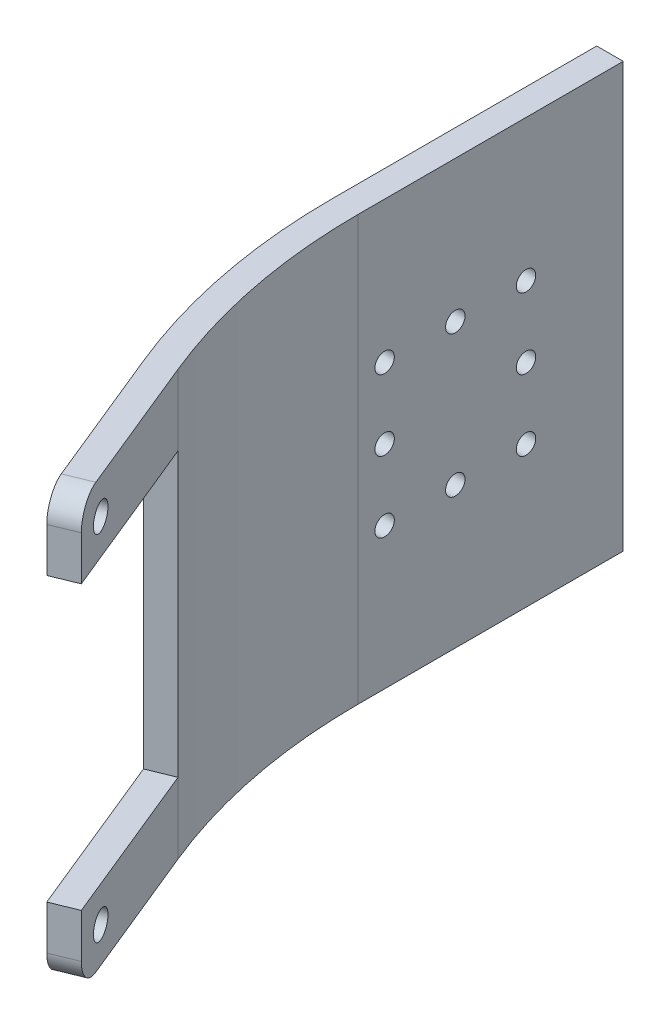
ISO-10303-21;
HEADER;
FILE_DESCRIPTION(('STEP AP214'),'2;1');
FILE_NAME('part.step','',(''),(''),'','','');
FILE_SCHEMA(('AUTOMOTIVE_DESIGN { 1 0 10303 214 1 1 1 1 }'));
ENDSEC;
DATA;
#1=APPLICATION_CONTEXT('core data for automotive mechanical design processes');
#2=APPLICATION_PROTOCOL_DEFINITION('international standard','automotive_design',2000,#1);
#3=PRODUCT_CONTEXT('',#1,'mechanical');
#4=PRODUCT('Part','Part','',(#3));
#5=PRODUCT_RELATED_PRODUCT_CATEGORY('part','',(#4));
#6=PRODUCT_DEFINITION_FORMATION('','',#4);
#7=PRODUCT_DEFINITION_CONTEXT('part definition',#1,'design');
#8=PRODUCT_DEFINITION('design','',#6,#7);
#9=PRODUCT_DEFINITION_SHAPE('','',#8);
#10=(LENGTH_UNIT() NAMED_UNIT(*) SI_UNIT(.MILLI.,.METRE.));
#11=(NAMED_UNIT(*) PLANE_ANGLE_UNIT() SI_UNIT($,.RADIAN.));
#12=(NAMED_UNIT(*) SI_UNIT($,.STERADIAN.) SOLID_ANGLE_UNIT());
#13=UNCERTAINTY_MEASURE_WITH_UNIT(LENGTH_MEASURE(1.E-05),#10,'distance_accuracy_value','');
#14=(GEOMETRIC_REPRESENTATION_CONTEXT(3) GLOBAL_UNCERTAINTY_ASSIGNED_CONTEXT((#13)) GLOBAL_UNIT_ASSIGNED_CONTEXT((#10,
#11,#12)) REPRESENTATION_CONTEXT('',''));
#15=CARTESIAN_POINT('',(0.,0.,0.));
#16=DIRECTION('',(0.,0.,1.));
#17=DIRECTION('',(1.,0.,0.));
#18=AXIS2_PLACEMENT_3D('',#15,#16,#17);
#19=CARTESIAN_POINT('',(5.20465717257355,48.,26.4870449064496));
#20=DIRECTION('',(0.925647754677521,0.,-0.378386355806422));
#21=DIRECTION('',(-0.378386355806423,0.,-0.925647754677521));
#22=AXIS2_PLACEMENT_3D('',#19,#20,#21);
#23=PLANE('',#22);
#24=CARTESIAN_POINT('',(11.2588388654763,44.,41.2974089812899));
#25=DIRECTION('',(-0.925647754677521,0.,0.378386355806422));
#26=DIRECTION('',(-0.378386355806422,0.,-0.925647754677521));
#27=AXIS2_PLACEMENT_3D('',#24,#25,#26);
#28=CIRCLE('',#27,1.5);
#29=CARTESIAN_POINT('',(10.6912593317667,44.,39.9089373492736));
#30=VERTEX_POINT('',#29);
#31=EDGE_CURVE('E365',#30,#30,#28,.T.);
#32=ORIENTED_EDGE('',*,*,#31,.F.);
#33=EDGE_LOOP('',(#32));
#34=FACE_BOUND('',#33,.T.);
#35=DIRECTION('',(0.,-1.,0.));
#36=VECTOR('',#35,1.);
#37=CARTESIAN_POINT('',(12.772384288702,48.,45.));
#38=LINE('',#37,#36);
#39=CARTESIAN_POINT('',(12.772384288702,45.,45.));
#40=VERTEX_POINT('',#39);
#41=CARTESIAN_POINT('',(12.772384288702,40.,45.));
#42=VERTEX_POINT('',#41);
#43=EDGE_CURVE('E176',#40,#42,#38,.T.);
#44=ORIENTED_EDGE('',*,*,#43,.F.);
#45=CARTESIAN_POINT('',(11.6372252212827,45.,42.2230567359674));
#46=DIRECTION('',(0.925647754677521,0.,-0.378386355806422));
#47=DIRECTION('',(-0.378386355806423,0.,-0.925647754677521));
#48=AXIS2_PLACEMENT_3D('',#45,#46,#47);
#49=CIRCLE('',#48,3.);
#50=CARTESIAN_POINT('',(11.6372252212827,48.,42.2230567359674));
#51=VERTEX_POINT('',#50);
#52=EDGE_CURVE('E11',#40,#51,#49,.F.);
#53=ORIENTED_EDGE('',*,*,#52,.T.);
#54=DIRECTION('',(0.378386355806422,0.,0.925647754677521));
#55=VECTOR('',#54,1.);
#56=CARTESIAN_POINT('',(5.20465717257355,48.,26.4870449064496));
#57=LINE('',#56,#55);
#58=CARTESIAN_POINT('',(5.20465717257355,48.,26.4870449064496));
#59=VERTEX_POINT('',#58);
#60=EDGE_CURVE('E200',#59,#51,#57,.T.);
#61=ORIENTED_EDGE('',*,*,#60,.F.);
#62=DIRECTION('',(0.,-1.,0.));
#63=VECTOR('',#62,1.);
#64=CARTESIAN_POINT('',(5.20465717257355,48.,26.4870449064496));
#65=LINE('',#64,#63);
#66=CARTESIAN_POINT('',(5.20465717257355,40.,26.4870449064496));
#67=VERTEX_POINT('',#66);
#68=EDGE_CURVE('E179',#59,#67,#65,.T.);
#69=ORIENTED_EDGE('',*,*,#68,.T.);
#70=DIRECTION('',(-0.378386355806423,0.,-0.925647754677521));
#71=VECTOR('',#70,1.);
#72=CARTESIAN_POINT('',(12.772384288702,40.,45.));
#73=LINE('',#72,#71);
#74=EDGE_CURVE('E138',#42,#67,#73,.T.);
#75=ORIENTED_EDGE('',*,*,#74,.F.);
#76=EDGE_LOOP('',(#44,#53,#61,#69,#75));
#77=FACE_BOUND('',#76,.T.);
#78=ADVANCED_FACE('F31',(#34,#77),#23,.F.);
#79=CARTESIAN_POINT('',(12.772384288702,48.,45.));
#80=DIRECTION('',(-0.378386355806423,0.,-0.92564775467752));
#81=DIRECTION('',(-0.92564775467752,0.,0.378386355806423));
#82=AXIS2_PLACEMENT_3D('',#79,#80,#81);
#83=PLANE('',#82);
#84=DIRECTION('',(0.,-1.,0.));
#85=VECTOR('',#84,1.);
#86=CARTESIAN_POINT('',(15.5493275527346,48.,43.8648409325807));
#87=LINE('',#86,#85);
#88=CARTESIAN_POINT('',(15.5493275527346,45.,43.8648409325807));
#89=VERTEX_POINT('',#88);
#90=CARTESIAN_POINT('',(15.5493275527346,40.,43.8648409325807));
#91=VERTEX_POINT('',#90);
#92=EDGE_CURVE('E160',#89,#91,#87,.T.);
#93=ORIENTED_EDGE('',*,*,#92,.F.);
#94=DIRECTION('',(0.92564775467752,0.,-0.378386355806423));
#95=VECTOR('',#94,1.);
#96=CARTESIAN_POINT('',(12.772384288702,45.,45.));
#97=LINE('',#96,#95);
#98=EDGE_CURVE('E39',#89,#40,#97,.F.);
#99=ORIENTED_EDGE('',*,*,#98,.T.);
#100=ORIENTED_EDGE('',*,*,#43,.T.);
#101=DIRECTION('',(-0.925647754677521,0.,0.378386355806422));
#102=VECTOR('',#101,1.);
#103=CARTESIAN_POINT('',(41.4218783986437,40.,33.2886577348907));
#104=LINE('',#103,#102);
#105=EDGE_CURVE('E154',#91,#42,#104,.T.);
#106=ORIENTED_EDGE('',*,*,#105,.F.);
#107=EDGE_LOOP('',(#93,#99,#100,#106));
#108=FACE_BOUND('',#107,.T.);
#109=ADVANCED_FACE('F278',(#108),#83,.F.);
#110=CARTESIAN_POINT('',(7.98160043660612,48.,25.3518858390303));
#111=DIRECTION('',(-0.925647754677521,0.,0.378386355806423));
#112=DIRECTION('',(0.378386355806423,0.,0.925647754677521));
#113=AXIS2_PLACEMENT_3D('',#110,#111,#112);
#114=PLANE('',#113);
#115=CARTESIAN_POINT('',(14.0357821295089,44.,40.1622499138706));
#116=DIRECTION('',(-0.925647754677521,0.,0.378386355806423));
#117=DIRECTION('',(0.378386355806423,0.,0.925647754677521));
#118=AXIS2_PLACEMENT_3D('',#115,#116,#117);
#119=CIRCLE('',#118,1.5);
#120=CARTESIAN_POINT('',(14.6033616632185,44.,41.5507215458869));
#121=VERTEX_POINT('',#120);
#122=EDGE_CURVE('E363',#121,#121,#119,.F.);
#123=ORIENTED_EDGE('',*,*,#122,.F.);
#124=EDGE_LOOP('',(#123));
#125=FACE_BOUND('',#124,.T.);
#126=DIRECTION('',(-0.378386355806423,0.,-0.925647754677521));
#127=VECTOR('',#126,1.);
#128=CARTESIAN_POINT('',(7.98160043660612,48.,25.3518858390303));
#129=LINE('',#128,#127);
#130=CARTESIAN_POINT('',(14.4141684853153,48.,41.0878976685482));
#131=VERTEX_POINT('',#130);
#132=CARTESIAN_POINT('',(7.98160043660612,48.,25.3518858390303));
#133=VERTEX_POINT('',#132);
#134=EDGE_CURVE('E198',#131,#133,#129,.T.);
#135=ORIENTED_EDGE('',*,*,#134,.F.);
#136=CARTESIAN_POINT('',(14.4141684853153,45.,41.0878976685482));
#137=DIRECTION('',(-0.925647754677521,0.,0.378386355806423));
#138=DIRECTION('',(0.378386355806423,0.,0.925647754677521));
#139=AXIS2_PLACEMENT_3D('',#136,#137,#138);
#140=CIRCLE('',#139,3.);
#141=EDGE_CURVE('E53',#131,#89,#140,.F.);
#142=ORIENTED_EDGE('',*,*,#141,.T.);
#143=ORIENTED_EDGE('',*,*,#92,.T.);
#144=DIRECTION('',(0.378386355806423,0.,0.925647754677521));
#145=VECTOR('',#144,1.);
#146=CARTESIAN_POINT('',(15.5493275527346,40.,43.8648409325807));
#147=LINE('',#146,#145);
#148=CARTESIAN_POINT('',(7.98160043660612,40.,25.3518858390303));
#149=VERTEX_POINT('',#148);
#150=EDGE_CURVE('E135',#149,#91,#147,.T.);
#151=ORIENTED_EDGE('',*,*,#150,.F.);
#152=DIRECTION('',(0.,-1.,0.));
#153=VECTOR('',#152,1.);
#154=CARTESIAN_POINT('',(7.98160043660612,48.,25.3518858390303));
#155=LINE('',#154,#153);
#156=EDGE_CURVE('E158',#133,#149,#155,.T.);
#157=ORIENTED_EDGE('',*,*,#156,.F.);
#158=EDGE_LOOP('',(#135,#142,#143,#151,#157));
#159=FACE_BOUND('',#158,.T.);
#160=ADVANCED_FACE('F157',(#125,#159),#114,.F.);
#161=CARTESIAN_POINT('',(70.,48.,0.));
#162=DIRECTION('',(0.,-1.,0.));
#163=DIRECTION('',(0.,0.,-1.));
#164=AXIS2_PLACEMENT_3D('',#161,#162,#163);
#165=CYLINDRICAL_SURFACE('',#164,70.);
#166=CARTESIAN_POINT('',(70.,0.,0.));
#167=DIRECTION('',(0.,1.,0.));
#168=DIRECTION('',(0.,0.,1.));
#169=AXIS2_PLACEMENT_3D('',#166,#167,#168);
#170=CIRCLE('',#169,70.);
#171=CARTESIAN_POINT('',(0.,0.,0.));
#172=VERTEX_POINT('',#171);
#173=CARTESIAN_POINT('',(5.20465717257355,0.,26.4870449064496));
#174=VERTEX_POINT('',#173);
#175=EDGE_CURVE('E153',#172,#174,#170,.T.);
#176=ORIENTED_EDGE('',*,*,#175,.T.);
#177=CARTESIAN_POINT('',(5.20465717257355,8.,26.4870449064496));
#178=VERTEX_POINT('',#177);
#179=EDGE_CURVE('E178',#178,#174,#65,.T.);
#180=ORIENTED_EDGE('',*,*,#179,.F.);
#181=DIRECTION('',(0.,-1.,0.));
#182=VECTOR('',#181,1.);
#183=CARTESIAN_POINT('',(5.20465717257355,8.,26.4870449064496));
#184=LINE('',#183,#182);
#185=EDGE_CURVE('E263',#67,#178,#184,.T.);
#186=ORIENTED_EDGE('',*,*,#185,.F.);
#187=ORIENTED_EDGE('',*,*,#68,.F.);
#188=CARTESIAN_POINT('',(70.,48.,0.));
#189=DIRECTION('',(0.,1.,0.));
#190=DIRECTION('',(0.,0.,1.));
#191=AXIS2_PLACEMENT_3D('',#188,#189,#190);
#192=CIRCLE('',#191,70.);
#193=CARTESIAN_POINT('',(0.,48.,0.));
#194=VERTEX_POINT('',#193);
#195=EDGE_CURVE('E206',#194,#59,#192,.T.);
#196=ORIENTED_EDGE('',*,*,#195,.F.);
#197=DIRECTION('',(0.,-1.,0.));
#198=VECTOR('',#197,1.);
#199=CARTESIAN_POINT('',(0.,48.,0.));
#200=LINE('',#199,#198);
#201=EDGE_CURVE('E215',#194,#172,#200,.T.);
#202=ORIENTED_EDGE('',*,*,#201,.T.);
#203=EDGE_LOOP('',(#176,#180,#186,#187,#196,#202));
#204=FACE_BOUND('',#203,.T.);
#205=ADVANCED_FACE('F261',(#204),#165,.T.);
#206=CARTESIAN_POINT('',(11.2588388654763,4.,41.2974089812899));
#207=DIRECTION('',(-0.925647754677521,0.,0.378386355806422));
#208=DIRECTION('',(0.378386355806422,0.,0.925647754677521));
#209=AXIS2_PLACEMENT_3D('',#206,#207,#208);
#210=CIRCLE('',#209,1.5);
#211=CARTESIAN_POINT('',(11.8264183991859,4.,42.6858806133062));
#212=VERTEX_POINT('',#211);
#213=EDGE_CURVE('E300',#212,#212,#210,.T.);
#214=ORIENTED_EDGE('',*,*,#213,.F.);
#215=EDGE_LOOP('',(#214));
#216=FACE_BOUND('',#215,.T.);
#217=DIRECTION('',(0.378386355806422,0.,0.925647754677521));
#218=VECTOR('',#217,1.);
#219=CARTESIAN_POINT('',(5.20465717257355,0.,26.4870449064496));
#220=LINE('',#219,#218);
#221=CARTESIAN_POINT('',(11.6372252212827,0.,42.2230567359674));
#222=VERTEX_POINT('',#221);
#223=EDGE_CURVE('E218',#174,#222,#220,.T.);
#224=ORIENTED_EDGE('',*,*,#223,.T.);
#225=CARTESIAN_POINT('',(11.6372252212827,3.,42.2230567359674));
#226=DIRECTION('',(0.925647754677521,0.,-0.378386355806422));
#227=DIRECTION('',(-0.378386355806423,0.,-0.925647754677521));
#228=AXIS2_PLACEMENT_3D('',#225,#226,#227);
#229=CIRCLE('',#228,3.);
#230=CARTESIAN_POINT('',(12.772384288702,3.,45.));
#231=VERTEX_POINT('',#230);
#232=EDGE_CURVE('E189',#222,#231,#229,.F.);
#233=ORIENTED_EDGE('',*,*,#232,.T.);
#234=CARTESIAN_POINT('',(12.772384288702,8.,45.));
#235=VERTEX_POINT('',#234);
#236=EDGE_CURVE('E175',#235,#231,#38,.T.);
#237=ORIENTED_EDGE('',*,*,#236,.F.);
#238=DIRECTION('',(0.378386355806422,0.,0.925647754677521));
#239=VECTOR('',#238,1.);
#240=CARTESIAN_POINT('',(12.772384288702,8.,45.));
#241=LINE('',#240,#239);
#242=EDGE_CURVE('E143',#178,#235,#241,.T.);
#243=ORIENTED_EDGE('',*,*,#242,.F.);
#244=ORIENTED_EDGE('',*,*,#179,.T.);
#245=EDGE_LOOP('',(#224,#233,#237,#243,#244));
#246=FACE_BOUND('',#245,.T.);
#247=ADVANCED_FACE('F281',(#216,#246),#23,.F.);
#248=ORIENTED_EDGE('',*,*,#236,.T.);
#249=DIRECTION('',(0.92564775467752,0.,-0.378386355806423));
#250=VECTOR('',#249,1.);
#251=CARTESIAN_POINT('',(12.772384288702,3.,45.));
#252=LINE('',#251,#250);
#253=CARTESIAN_POINT('',(15.5493275527346,3.,43.8648409325807));
#254=VERTEX_POINT('',#253);
#255=EDGE_CURVE('E182',#231,#254,#252,.T.);
#256=ORIENTED_EDGE('',*,*,#255,.T.);
#257=CARTESIAN_POINT('',(15.5493275527346,8.,43.8648409325807));
#258=VERTEX_POINT('',#257);
#259=EDGE_CURVE('E166',#258,#254,#87,.T.);
#260=ORIENTED_EDGE('',*,*,#259,.F.);
#261=DIRECTION('',(-0.925647754677521,0.,0.378386355806422));
#262=VECTOR('',#261,1.);
#263=CARTESIAN_POINT('',(41.4218783986437,8.,33.2886577348907));
#264=LINE('',#263,#262);
#265=EDGE_CURVE('E323',#258,#235,#264,.T.);
#266=ORIENTED_EDGE('',*,*,#265,.T.);
#267=EDGE_LOOP('',(#248,#256,#260,#266));
#268=FACE_BOUND('',#267,.T.);
#269=ADVANCED_FACE('F286',(#268),#83,.F.);
#270=CARTESIAN_POINT('',(14.0357821295089,4.,40.1622499138706));
#271=DIRECTION('',(-0.925647754677521,0.,0.378386355806423));
#272=DIRECTION('',(0.378386355806423,0.,0.925647754677521));
#273=AXIS2_PLACEMENT_3D('',#270,#271,#272);
#274=CIRCLE('',#273,1.5);
#275=CARTESIAN_POINT('',(14.6033616632185,4.,41.5507215458869));
#276=VERTEX_POINT('',#275);
#277=EDGE_CURVE('E313',#276,#276,#274,.F.);
#278=ORIENTED_EDGE('',*,*,#277,.F.);
#279=EDGE_LOOP('',(#278));
#280=FACE_BOUND('',#279,.T.);
#281=ORIENTED_EDGE('',*,*,#259,.T.);
#282=CARTESIAN_POINT('',(14.4141684853153,3.,41.0878976685482));
#283=DIRECTION('',(-0.925647754677521,0.,0.378386355806423));
#284=DIRECTION('',(0.378386355806423,0.,0.925647754677521));
#285=AXIS2_PLACEMENT_3D('',#282,#283,#284);
#286=CIRCLE('',#285,3.);
#287=CARTESIAN_POINT('',(14.4141684853153,0.,41.0878976685482));
#288=VERTEX_POINT('',#287);
#289=EDGE_CURVE('E185',#254,#288,#286,.F.);
#290=ORIENTED_EDGE('',*,*,#289,.T.);
#291=DIRECTION('',(-0.378386355806423,0.,-0.925647754677521));
#292=VECTOR('',#291,1.);
#293=CARTESIAN_POINT('',(7.98160043660612,0.,25.3518858390303));
#294=LINE('',#293,#292);
#295=CARTESIAN_POINT('',(7.98160043660612,0.,25.3518858390303));
#296=VERTEX_POINT('',#295);
#297=EDGE_CURVE('E221',#288,#296,#294,.T.);
#298=ORIENTED_EDGE('',*,*,#297,.T.);
#299=CARTESIAN_POINT('',(7.98160043660612,8.,25.3518858390303));
#300=VERTEX_POINT('',#299);
#301=EDGE_CURVE('E167',#300,#296,#155,.T.);
#302=ORIENTED_EDGE('',*,*,#301,.F.);
#303=DIRECTION('',(-0.378386355806423,0.,-0.925647754677521));
#304=VECTOR('',#303,1.);
#305=CARTESIAN_POINT('',(15.5493275527346,8.,43.8648409325807));
#306=LINE('',#305,#304);
#307=EDGE_CURVE('E161',#258,#300,#306,.T.);
#308=ORIENTED_EDGE('',*,*,#307,.F.);
#309=EDGE_LOOP('',(#281,#290,#298,#302,#308));
#310=FACE_BOUND('',#309,.T.);
#311=ADVANCED_FACE('F295',(#280,#310),#114,.F.);
#312=CARTESIAN_POINT('',(70.,48.,0.));
#313=DIRECTION('',(0.,-1.,0.));
#314=DIRECTION('',(0.,0.,-1.));
#315=AXIS2_PLACEMENT_3D('',#312,#313,#314);
#316=CYLINDRICAL_SURFACE('',#315,67.);
#317=CARTESIAN_POINT('',(70.,0.,0.));
#318=DIRECTION('',(0.,-1.,0.));
#319=DIRECTION('',(0.,0.,1.));
#320=AXIS2_PLACEMENT_3D('',#317,#318,#319);
#321=CIRCLE('',#320,67.);
#322=CARTESIAN_POINT('',(3.00000000000001,0.,7.12266617214352E-13));
#323=VERTEX_POINT('',#322);
#324=EDGE_CURVE('E223',#296,#323,#321,.T.);
#325=ORIENTED_EDGE('',*,*,#324,.T.);
#326=DIRECTION('',(0.,-1.,0.));
#327=VECTOR('',#326,1.);
#328=CARTESIAN_POINT('',(3.00000000000001,48.,7.12266617214352E-13));
#329=LINE('',#328,#327);
#330=CARTESIAN_POINT('',(3.00000000000001,48.,7.12266617214352E-13));
#331=VERTEX_POINT('',#330);
#332=EDGE_CURVE('E171',#331,#323,#329,.T.);
#333=ORIENTED_EDGE('',*,*,#332,.F.);
#334=CARTESIAN_POINT('',(70.,48.,0.));
#335=DIRECTION('',(0.,-1.,0.));
#336=DIRECTION('',(0.,0.,1.));
#337=AXIS2_PLACEMENT_3D('',#334,#335,#336);
#338=CIRCLE('',#337,67.);
#339=EDGE_CURVE('E165',#133,#331,#338,.T.);
#340=ORIENTED_EDGE('',*,*,#339,.F.);
#341=ORIENTED_EDGE('',*,*,#156,.T.);
#342=DIRECTION('',(0.,-1.,0.));
#343=VECTOR('',#342,1.);
#344=CARTESIAN_POINT('',(7.98160043660611,48.,25.3518858390303));
#345=LINE('',#344,#343);
#346=EDGE_CURVE('E147',#300,#149,#345,.F.);
#347=ORIENTED_EDGE('',*,*,#346,.F.);
#348=ORIENTED_EDGE('',*,*,#301,.T.);
#349=EDGE_LOOP('',(#325,#333,#340,#341,#347,#348));
#350=FACE_BOUND('',#349,.T.);
#351=ADVANCED_FACE('F163',(#350),#316,.F.);
#352=CARTESIAN_POINT('',(3.,48.,-30.));
#353=DIRECTION('',(-1.,0.,0.));
#354=DIRECTION('',(0.,0.,1.));
#355=AXIS2_PLACEMENT_3D('',#352,#353,#354);
#356=PLANE('',#355);
#357=CARTESIAN_POINT('',(3.00000000000001,32.,-2.99999999999999));
#358=DIRECTION('',(1.,0.,0.));
#359=DIRECTION('',(0.,0.,1.));
#360=AXIS2_PLACEMENT_3D('',#357,#358,#359);
#361=CIRCLE('',#360,1.1);
#362=CARTESIAN_POINT('',(3.00000000000001,32.,-1.89999999999999));
#363=VERTEX_POINT('',#362);
#364=EDGE_CURVE('E415',#363,#363,#361,.T.);
#365=ORIENTED_EDGE('',*,*,#364,.F.);
#366=EDGE_LOOP('',(#365));
#367=FACE_BOUND('',#366,.T.);
#368=CARTESIAN_POINT('',(3.,32.,-11.));
#369=DIRECTION('',(1.,0.,0.));
#370=DIRECTION('',(0.,0.,1.));
#371=AXIS2_PLACEMENT_3D('',#368,#369,#370);
#372=CIRCLE('',#371,1.1);
#373=CARTESIAN_POINT('',(3.,32.,-9.9));
#374=VERTEX_POINT('',#373);
#375=EDGE_CURVE('E409',#374,#374,#372,.T.);
#376=ORIENTED_EDGE('',*,*,#375,.F.);
#377=EDGE_LOOP('',(#376));
#378=FACE_BOUND('',#377,.T.);
#379=CARTESIAN_POINT('',(3.,32.,-19.));
#380=DIRECTION('',(1.,0.,0.));
#381=DIRECTION('',(0.,0.,1.));
#382=AXIS2_PLACEMENT_3D('',#379,#380,#381);
#383=CIRCLE('',#382,1.1);
#384=CARTESIAN_POINT('',(3.,32.,-17.9));
#385=VERTEX_POINT('',#384);
#386=EDGE_CURVE('E403',#385,#385,#383,.T.);
#387=ORIENTED_EDGE('',*,*,#386,.F.);
#388=EDGE_LOOP('',(#387));
#389=FACE_BOUND('',#388,.T.);
#390=CARTESIAN_POINT('',(3.,24.,-19.));
#391=DIRECTION('',(1.,0.,0.));
#392=DIRECTION('',(0.,0.,-1.));
#393=AXIS2_PLACEMENT_3D('',#390,#391,#392);
#394=CIRCLE('',#393,1.1);
#395=CARTESIAN_POINT('',(3.,24.,-20.1));
#396=VERTEX_POINT('',#395);
#397=EDGE_CURVE('E397',#396,#396,#394,.T.);
#398=ORIENTED_EDGE('',*,*,#397,.F.);
#399=EDGE_LOOP('',(#398));
#400=FACE_BOUND('',#399,.T.);
#401=CARTESIAN_POINT('',(3.00000000000001,24.,-3.));
#402=DIRECTION('',(1.,0.,0.));
#403=DIRECTION('',(0.,0.,-1.));
#404=AXIS2_PLACEMENT_3D('',#401,#402,#403);
#405=CIRCLE('',#404,1.1);
#406=CARTESIAN_POINT('',(3.,24.,-4.1));
#407=VERTEX_POINT('',#406);
#408=EDGE_CURVE('E391',#407,#407,#405,.T.);
#409=ORIENTED_EDGE('',*,*,#408,.F.);
#410=EDGE_LOOP('',(#409));
#411=FACE_BOUND('',#410,.T.);
#412=CARTESIAN_POINT('',(3.,16.,-19.));
#413=DIRECTION('',(1.,0.,0.));
#414=DIRECTION('',(0.,0.,-1.));
#415=AXIS2_PLACEMENT_3D('',#412,#413,#414);
#416=CIRCLE('',#415,1.1);
#417=CARTESIAN_POINT('',(3.,16.,-20.1));
#418=VERTEX_POINT('',#417);
#419=EDGE_CURVE('E385',#418,#418,#416,.T.);
#420=ORIENTED_EDGE('',*,*,#419,.F.);
#421=EDGE_LOOP('',(#420));
#422=FACE_BOUND('',#421,.T.);
#423=CARTESIAN_POINT('',(3.,16.,-11.));
#424=DIRECTION('',(1.,0.,0.));
#425=DIRECTION('',(0.,0.,-1.));
#426=AXIS2_PLACEMENT_3D('',#423,#424,#425);
#427=CIRCLE('',#426,1.1);
#428=CARTESIAN_POINT('',(3.,16.,-12.1));
#429=VERTEX_POINT('',#428);
#430=EDGE_CURVE('E379',#429,#429,#427,.T.);
#431=ORIENTED_EDGE('',*,*,#430,.F.);
#432=EDGE_LOOP('',(#431));
#433=FACE_BOUND('',#432,.T.);
#434=CARTESIAN_POINT('',(3.00000000000001,16.,-3.));
#435=DIRECTION('',(1.,0.,0.));
#436=DIRECTION('',(0.,0.,-1.));
#437=AXIS2_PLACEMENT_3D('',#434,#435,#436);
#438=CIRCLE('',#437,1.1);
#439=CARTESIAN_POINT('',(3.,16.,-4.1));
#440=VERTEX_POINT('',#439);
#441=EDGE_CURVE('E373',#440,#440,#438,.T.);
#442=ORIENTED_EDGE('',*,*,#441,.F.);
#443=EDGE_LOOP('',(#442));
#444=FACE_BOUND('',#443,.T.);
#445=DIRECTION('',(0.,0.,-1.));
#446=VECTOR('',#445,1.);
#447=CARTESIAN_POINT('',(3.,0.,-30.));
#448=LINE('',#447,#446);
#449=CARTESIAN_POINT('',(3.,0.,-30.));
#450=VERTEX_POINT('',#449);
#451=EDGE_CURVE('E225',#323,#450,#448,.T.);
#452=ORIENTED_EDGE('',*,*,#451,.T.);
#453=DIRECTION('',(0.,-1.,0.));
#454=VECTOR('',#453,1.);
#455=CARTESIAN_POINT('',(3.,48.,-30.));
#456=LINE('',#455,#454);
#457=CARTESIAN_POINT('',(3.,48.,-30.));
#458=VERTEX_POINT('',#457);
#459=EDGE_CURVE('E235',#458,#450,#456,.T.);
#460=ORIENTED_EDGE('',*,*,#459,.F.);
#461=DIRECTION('',(0.,0.,-1.));
#462=VECTOR('',#461,1.);
#463=CARTESIAN_POINT('',(3.,48.,-30.));
#464=LINE('',#463,#462);
#465=EDGE_CURVE('E204',#331,#458,#464,.T.);
#466=ORIENTED_EDGE('',*,*,#465,.F.);
#467=ORIENTED_EDGE('',*,*,#332,.T.);
#468=EDGE_LOOP('',(#452,#460,#466,#467));
#469=FACE_BOUND('',#468,.T.);
#470=ADVANCED_FACE('F245',(#367,#378,#389,#400,#411,#422,#433,#444,#469),#356,.F.);
#471=CARTESIAN_POINT('',(0.,48.,-30.));
#472=DIRECTION('',(0.,0.,1.));
#473=DIRECTION('',(1.,0.,0.));
#474=AXIS2_PLACEMENT_3D('',#471,#472,#473);
#475=PLANE('',#474);
#476=DIRECTION('',(-1.,0.,0.));
#477=VECTOR('',#476,1.);
#478=CARTESIAN_POINT('',(0.,0.,-30.));
#479=LINE('',#478,#477);
#480=CARTESIAN_POINT('',(0.,0.,-30.));
#481=VERTEX_POINT('',#480);
#482=EDGE_CURVE('E227',#450,#481,#479,.T.);
#483=ORIENTED_EDGE('',*,*,#482,.T.);
#484=DIRECTION('',(0.,-1.,0.));
#485=VECTOR('',#484,1.);
#486=CARTESIAN_POINT('',(0.,48.,-30.));
#487=LINE('',#486,#485);
#488=CARTESIAN_POINT('',(0.,48.,-30.));
#489=VERTEX_POINT('',#488);
#490=EDGE_CURVE('E233',#489,#481,#487,.T.);
#491=ORIENTED_EDGE('',*,*,#490,.F.);
#492=DIRECTION('',(-1.,0.,0.));
#493=VECTOR('',#492,1.);
#494=CARTESIAN_POINT('',(0.,48.,-30.));
#495=LINE('',#494,#493);
#496=EDGE_CURVE('E211',#458,#489,#495,.T.);
#497=ORIENTED_EDGE('',*,*,#496,.F.);
#498=ORIENTED_EDGE('',*,*,#459,.T.);
#499=EDGE_LOOP('',(#483,#491,#497,#498));
#500=FACE_BOUND('',#499,.T.);
#501=ADVANCED_FACE('F253',(#500),#475,.F.);
#502=CARTESIAN_POINT('',(0.,48.,0.));
#503=DIRECTION('',(1.,0.,0.));
#504=DIRECTION('',(0.,0.,-1.));
#505=AXIS2_PLACEMENT_3D('',#502,#503,#504);
#506=PLANE('',#505);
#507=CARTESIAN_POINT('',(0.,32.,-2.99999999999999));
#508=DIRECTION('',(1.,0.,0.));
#509=DIRECTION('',(0.,0.,-1.));
#510=AXIS2_PLACEMENT_3D('',#507,#508,#509);
#511=CIRCLE('',#510,1.1);
#512=CARTESIAN_POINT('',(0.,32.,-4.1));
#513=VERTEX_POINT('',#512);
#514=EDGE_CURVE('E412',#513,#513,#511,.F.);
#515=ORIENTED_EDGE('',*,*,#514,.F.);
#516=EDGE_LOOP('',(#515));
#517=FACE_BOUND('',#516,.T.);
#518=CARTESIAN_POINT('',(0.,32.,-11.));
#519=DIRECTION('',(1.,0.,0.));
#520=DIRECTION('',(0.,0.,-1.));
#521=AXIS2_PLACEMENT_3D('',#518,#519,#520);
#522=CIRCLE('',#521,1.1);
#523=CARTESIAN_POINT('',(0.,32.,-12.1));
#524=VERTEX_POINT('',#523);
#525=EDGE_CURVE('E406',#524,#524,#522,.F.);
#526=ORIENTED_EDGE('',*,*,#525,.F.);
#527=EDGE_LOOP('',(#526));
#528=FACE_BOUND('',#527,.T.);
#529=CARTESIAN_POINT('',(0.,32.,-19.));
#530=DIRECTION('',(1.,0.,0.));
#531=DIRECTION('',(0.,0.,-1.));
#532=AXIS2_PLACEMENT_3D('',#529,#530,#531);
#533=CIRCLE('',#532,1.1);
#534=CARTESIAN_POINT('',(0.,32.,-20.1));
#535=VERTEX_POINT('',#534);
#536=EDGE_CURVE('E400',#535,#535,#533,.F.);
#537=ORIENTED_EDGE('',*,*,#536,.F.);
#538=EDGE_LOOP('',(#537));
#539=FACE_BOUND('',#538,.T.);
#540=CARTESIAN_POINT('',(0.,24.,-19.));
#541=DIRECTION('',(1.,0.,0.));
#542=DIRECTION('',(0.,0.,-1.));
#543=AXIS2_PLACEMENT_3D('',#540,#541,#542);
#544=CIRCLE('',#543,1.1);
#545=CARTESIAN_POINT('',(0.,24.,-20.1));
#546=VERTEX_POINT('',#545);
#547=EDGE_CURVE('E394',#546,#546,#544,.F.);
#548=ORIENTED_EDGE('',*,*,#547,.F.);
#549=EDGE_LOOP('',(#548));
#550=FACE_BOUND('',#549,.T.);
#551=CARTESIAN_POINT('',(0.,24.,-3.));
#552=DIRECTION('',(1.,0.,0.));
#553=DIRECTION('',(0.,0.,-1.));
#554=AXIS2_PLACEMENT_3D('',#551,#552,#553);
#555=CIRCLE('',#554,1.1);
#556=CARTESIAN_POINT('',(0.,24.,-4.1));
#557=VERTEX_POINT('',#556);
#558=EDGE_CURVE('E388',#557,#557,#555,.F.);
#559=ORIENTED_EDGE('',*,*,#558,.F.);
#560=EDGE_LOOP('',(#559));
#561=FACE_BOUND('',#560,.T.);
#562=CARTESIAN_POINT('',(0.,16.,-19.));
#563=DIRECTION('',(1.,0.,0.));
#564=DIRECTION('',(0.,0.,-1.));
#565=AXIS2_PLACEMENT_3D('',#562,#563,#564);
#566=CIRCLE('',#565,1.1);
#567=CARTESIAN_POINT('',(0.,16.,-20.1));
#568=VERTEX_POINT('',#567);
#569=EDGE_CURVE('E382',#568,#568,#566,.F.);
#570=ORIENTED_EDGE('',*,*,#569,.F.);
#571=EDGE_LOOP('',(#570));
#572=FACE_BOUND('',#571,.T.);
#573=CARTESIAN_POINT('',(0.,16.,-11.));
#574=DIRECTION('',(1.,0.,0.));
#575=DIRECTION('',(0.,0.,-1.));
#576=AXIS2_PLACEMENT_3D('',#573,#574,#575);
#577=CIRCLE('',#576,1.1);
#578=CARTESIAN_POINT('',(0.,16.,-12.1));
#579=VERTEX_POINT('',#578);
#580=EDGE_CURVE('E376',#579,#579,#577,.F.);
#581=ORIENTED_EDGE('',*,*,#580,.F.);
#582=EDGE_LOOP('',(#581));
#583=FACE_BOUND('',#582,.T.);
#584=CARTESIAN_POINT('',(0.,16.,-3.));
#585=DIRECTION('',(1.,0.,0.));
#586=DIRECTION('',(0.,0.,-1.));
#587=AXIS2_PLACEMENT_3D('',#584,#585,#586);
#588=CIRCLE('',#587,1.1);
#589=CARTESIAN_POINT('',(0.,16.,-4.1));
#590=VERTEX_POINT('',#589);
#591=EDGE_CURVE('E368',#590,#590,#588,.F.);
#592=ORIENTED_EDGE('',*,*,#591,.F.);
#593=EDGE_LOOP('',(#592));
#594=FACE_BOUND('',#593,.T.);
#595=DIRECTION('',(0.,0.,1.));
#596=VECTOR('',#595,1.);
#597=CARTESIAN_POINT('',(0.,0.,0.));
#598=LINE('',#597,#596);
#599=EDGE_CURVE('E229',#481,#172,#598,.T.);
#600=ORIENTED_EDGE('',*,*,#599,.T.);
#601=ORIENTED_EDGE('',*,*,#201,.F.);
#602=DIRECTION('',(0.,0.,1.));
#603=VECTOR('',#602,1.);
#604=CARTESIAN_POINT('',(0.,48.,0.));
#605=LINE('',#604,#603);
#606=EDGE_CURVE('E213',#489,#194,#605,.T.);
#607=ORIENTED_EDGE('',*,*,#606,.F.);
#608=ORIENTED_EDGE('',*,*,#490,.T.);
#609=EDGE_LOOP('',(#600,#601,#607,#608));
#610=FACE_BOUND('',#609,.T.);
#611=ADVANCED_FACE('F256',(#517,#528,#539,#550,#561,#572,#583,#594,#610),#506,.F.);
#612=CARTESIAN_POINT('',(70.,48.,0.));
#613=DIRECTION('',(0.,1.,0.));
#614=DIRECTION('',(0.,0.,1.));
#615=AXIS2_PLACEMENT_3D('',#612,#613,#614);
#616=PLANE('',#615);
#617=ORIENTED_EDGE('',*,*,#60,.T.);
#618=DIRECTION('',(0.92564775467752,0.,-0.378386355806423));
#619=VECTOR('',#618,1.);
#620=CARTESIAN_POINT('',(14.4141684853153,48.,41.0878976685482));
#621=LINE('',#620,#619);
#622=EDGE_CURVE('E191',#51,#131,#621,.T.);
#623=ORIENTED_EDGE('',*,*,#622,.T.);
#624=ORIENTED_EDGE('',*,*,#134,.T.);
#625=ORIENTED_EDGE('',*,*,#339,.T.);
#626=ORIENTED_EDGE('',*,*,#465,.T.);
#627=ORIENTED_EDGE('',*,*,#496,.T.);
#628=ORIENTED_EDGE('',*,*,#606,.T.);
#629=ORIENTED_EDGE('',*,*,#195,.T.);
#630=EDGE_LOOP('',(#617,#623,#624,#625,#626,#627,#628,#629));
#631=FACE_BOUND('',#630,.T.);
#632=ADVANCED_FACE('F197',(#631),#616,.T.);
#633=CARTESIAN_POINT('',(70.,0.,0.));
#634=DIRECTION('',(0.,1.,0.));
#635=DIRECTION('',(0.,0.,1.));
#636=AXIS2_PLACEMENT_3D('',#633,#634,#635);
#637=PLANE('',#636);
#638=ORIENTED_EDGE('',*,*,#297,.F.);
#639=DIRECTION('',(0.92564775467752,0.,-0.378386355806423));
#640=VECTOR('',#639,1.);
#641=CARTESIAN_POINT('',(76.4325680487092,0.,15.7360118295178));
#642=LINE('',#641,#640);
#643=EDGE_CURVE('E187',#288,#222,#642,.F.);
#644=ORIENTED_EDGE('',*,*,#643,.T.);
#645=ORIENTED_EDGE('',*,*,#223,.F.);
#646=ORIENTED_EDGE('',*,*,#175,.F.);
#647=ORIENTED_EDGE('',*,*,#599,.F.);
#648=ORIENTED_EDGE('',*,*,#482,.F.);
#649=ORIENTED_EDGE('',*,*,#451,.F.);
#650=ORIENTED_EDGE('',*,*,#324,.F.);
#651=EDGE_LOOP('',(#638,#644,#645,#646,#647,#648,#649,#650));
#652=FACE_BOUND('',#651,.T.);
#653=ADVANCED_FACE('F249',(#652),#637,.F.);
#654=CARTESIAN_POINT('',(41.4218783986437,40.,33.2886577348907));
#655=DIRECTION('',(0.,1.,0.));
#656=DIRECTION('',(0.,0.,1.));
#657=AXIS2_PLACEMENT_3D('',#654,#655,#656);
#658=PLANE('',#657);
#659=ORIENTED_EDGE('',*,*,#150,.T.);
#660=ORIENTED_EDGE('',*,*,#105,.T.);
#661=ORIENTED_EDGE('',*,*,#74,.T.);
#662=DIRECTION('',(-0.925647754677521,0.,0.378386355806422));
#663=VECTOR('',#662,1.);
#664=CARTESIAN_POINT('',(33.8541512825152,40.,14.7757026413403));
#665=LINE('',#664,#663);
#666=EDGE_CURVE('E130',#149,#67,#665,.T.);
#667=ORIENTED_EDGE('',*,*,#666,.F.);
#668=EDGE_LOOP('',(#659,#660,#661,#667));
#669=FACE_BOUND('',#668,.T.);
#670=ADVANCED_FACE('F132',(#669),#658,.F.);
#671=CARTESIAN_POINT('',(41.4218783986437,8.,33.2886577348907));
#672=DIRECTION('',(0.,-1.,0.));
#673=DIRECTION('',(0.,0.,-1.));
#674=AXIS2_PLACEMENT_3D('',#671,#672,#673);
#675=PLANE('',#674);
#676=ORIENTED_EDGE('',*,*,#307,.T.);
#677=DIRECTION('',(-0.925647754677521,0.,0.378386355806422));
#678=VECTOR('',#677,1.);
#679=CARTESIAN_POINT('',(33.8541512825152,8.,14.7757026413403));
#680=LINE('',#679,#678);
#681=EDGE_CURVE('E142',#300,#178,#680,.T.);
#682=ORIENTED_EDGE('',*,*,#681,.T.);
#683=ORIENTED_EDGE('',*,*,#242,.T.);
#684=ORIENTED_EDGE('',*,*,#265,.F.);
#685=EDGE_LOOP('',(#676,#682,#683,#684));
#686=FACE_BOUND('',#685,.T.);
#687=ADVANCED_FACE('F325',(#686),#675,.F.);
#688=CARTESIAN_POINT('',(33.8541512825152,8.,14.7757026413403));
#689=DIRECTION('',(-0.378386355806422,0.,-0.925647754677521));
#690=DIRECTION('',(-0.925647754677521,0.,0.378386355806422));
#691=AXIS2_PLACEMENT_3D('',#688,#689,#690);
#692=PLANE('',#691);
#693=ORIENTED_EDGE('',*,*,#346,.T.);
#694=ORIENTED_EDGE('',*,*,#666,.T.);
#695=ORIENTED_EDGE('',*,*,#185,.T.);
#696=ORIENTED_EDGE('',*,*,#681,.F.);
#697=EDGE_LOOP('',(#693,#694,#695,#696));
#698=FACE_BOUND('',#697,.T.);
#699=ADVANCED_FACE('F148',(#698),#692,.F.);
#700=CARTESIAN_POINT('',(39.908332975418,4.,29.5860667161806));
#701=DIRECTION('',(-0.925647754677521,0.,0.378386355806422));
#702=DIRECTION('',(0.378386355806422,0.,0.925647754677521));
#703=AXIS2_PLACEMENT_3D('',#700,#701,#702);
#704=CYLINDRICAL_SURFACE('',#703,1.5);
#705=ORIENTED_EDGE('',*,*,#213,.T.);
#706=EDGE_LOOP('',(#705));
#707=FACE_BOUND('',#706,.T.);
#708=ORIENTED_EDGE('',*,*,#277,.T.);
#709=EDGE_LOOP('',(#708));
#710=FACE_BOUND('',#709,.T.);
#711=ADVANCED_FACE('F332',(#707,#710),#704,.F.);
#712=CARTESIAN_POINT('',(39.908332975418,44.,29.5860667161806));
#713=DIRECTION('',(-0.925647754677521,0.,0.378386355806422));
#714=DIRECTION('',(0.378386355806422,0.,0.925647754677521));
#715=AXIS2_PLACEMENT_3D('',#712,#713,#714);
#716=CYLINDRICAL_SURFACE('',#715,1.5);
#717=ORIENTED_EDGE('',*,*,#31,.T.);
#718=EDGE_LOOP('',(#717));
#719=FACE_BOUND('',#718,.T.);
#720=ORIENTED_EDGE('',*,*,#122,.T.);
#721=EDGE_LOOP('',(#720));
#722=FACE_BOUND('',#721,.T.);
#723=ADVANCED_FACE('F275',(#719,#722),#716,.F.);
#724=CARTESIAN_POINT('',(11.6372252212827,3.,42.2230567359674));
#725=DIRECTION('',(0.92564775467752,0.,-0.378386355806423));
#726=DIRECTION('',(-0.378386355806423,0.,-0.92564775467752));
#727=AXIS2_PLACEMENT_3D('',#724,#725,#726);
#728=CYLINDRICAL_SURFACE('',#727,3.);
#729=ORIENTED_EDGE('',*,*,#232,.F.);
#730=ORIENTED_EDGE('',*,*,#643,.F.);
#731=ORIENTED_EDGE('',*,*,#289,.F.);
#732=ORIENTED_EDGE('',*,*,#255,.F.);
#733=EDGE_LOOP('',(#729,#730,#731,#732));
#734=FACE_BOUND('',#733,.T.);
#735=ADVANCED_FACE('F267',(#734),#728,.T.);
#736=CARTESIAN_POINT('',(76.4325680487092,45.,15.7360118295178));
#737=DIRECTION('',(-0.92564775467752,0.,0.378386355806423));
#738=DIRECTION('',(0.378386355806423,0.,0.92564775467752));
#739=AXIS2_PLACEMENT_3D('',#736,#737,#738);
#740=CYLINDRICAL_SURFACE('',#739,3.);
#741=ORIENTED_EDGE('',*,*,#52,.F.);
#742=ORIENTED_EDGE('',*,*,#98,.F.);
#743=ORIENTED_EDGE('',*,*,#141,.F.);
#744=ORIENTED_EDGE('',*,*,#622,.F.);
#745=EDGE_LOOP('',(#741,#742,#743,#744));
#746=FACE_BOUND('',#745,.T.);
#747=ADVANCED_FACE('F33',(#746),#740,.T.);
#748=CARTESIAN_POINT('',(-0.00100000000001184,16.,-3.));
#749=DIRECTION('',(1.,0.,0.));
#750=DIRECTION('',(0.,0.,-1.));
#751=AXIS2_PLACEMENT_3D('',#748,#749,#750);
#752=CYLINDRICAL_SURFACE('',#751,1.1);
#753=ORIENTED_EDGE('',*,*,#441,.T.);
#754=EDGE_LOOP('',(#753));
#755=FACE_BOUND('',#754,.T.);
#756=ORIENTED_EDGE('',*,*,#591,.T.);
#757=EDGE_LOOP('',(#756));
#758=FACE_BOUND('',#757,.T.);
#759=ADVANCED_FACE('F266',(#755,#758),#752,.F.);
#760=CARTESIAN_POINT('',(-0.00100000000001358,16.,-11.));
#761=DIRECTION('',(1.,0.,0.));
#762=DIRECTION('',(0.,0.,-1.));
#763=AXIS2_PLACEMENT_3D('',#760,#761,#762);
#764=CYLINDRICAL_SURFACE('',#763,1.1);
#765=ORIENTED_EDGE('',*,*,#430,.T.);
#766=EDGE_LOOP('',(#765));
#767=FACE_BOUND('',#766,.T.);
#768=ORIENTED_EDGE('',*,*,#580,.T.);
#769=EDGE_LOOP('',(#768));
#770=FACE_BOUND('',#769,.T.);
#771=ADVANCED_FACE('F272',(#767,#770),#764,.F.);
#772=CARTESIAN_POINT('',(-0.00100000000001575,16.,-19.));
#773=DIRECTION('',(1.,0.,0.));
#774=DIRECTION('',(0.,0.,-1.));
#775=AXIS2_PLACEMENT_3D('',#772,#773,#774);
#776=CYLINDRICAL_SURFACE('',#775,1.1);
#777=ORIENTED_EDGE('',*,*,#419,.T.);
#778=EDGE_LOOP('',(#777));
#779=FACE_BOUND('',#778,.T.);
#780=ORIENTED_EDGE('',*,*,#569,.T.);
#781=EDGE_LOOP('',(#780));
#782=FACE_BOUND('',#781,.T.);
#783=ADVANCED_FACE('F441',(#779,#782),#776,.F.);
#784=CARTESIAN_POINT('',(-0.00100000000001184,24.,-3.));
#785=DIRECTION('',(1.,0.,0.));
#786=DIRECTION('',(0.,0.,-1.));
#787=AXIS2_PLACEMENT_3D('',#784,#785,#786);
#788=CYLINDRICAL_SURFACE('',#787,1.1);
#789=ORIENTED_EDGE('',*,*,#408,.T.);
#790=EDGE_LOOP('',(#789));
#791=FACE_BOUND('',#790,.T.);
#792=ORIENTED_EDGE('',*,*,#558,.T.);
#793=EDGE_LOOP('',(#792));
#794=FACE_BOUND('',#793,.T.);
#795=ADVANCED_FACE('F448',(#791,#794),#788,.F.);
#796=CARTESIAN_POINT('',(-0.00100000000001575,24.,-19.));
#797=DIRECTION('',(1.,0.,0.));
#798=DIRECTION('',(0.,0.,-1.));
#799=AXIS2_PLACEMENT_3D('',#796,#797,#798);
#800=CYLINDRICAL_SURFACE('',#799,1.1);
#801=ORIENTED_EDGE('',*,*,#397,.T.);
#802=EDGE_LOOP('',(#801));
#803=FACE_BOUND('',#802,.T.);
#804=ORIENTED_EDGE('',*,*,#547,.T.);
#805=EDGE_LOOP('',(#804));
#806=FACE_BOUND('',#805,.T.);
#807=ADVANCED_FACE('F552',(#803,#806),#800,.F.);
#808=CARTESIAN_POINT('',(-0.00100000000001575,32.,-19.));
#809=DIRECTION('',(1.,0.,0.));
#810=DIRECTION('',(0.,0.,-1.));
#811=AXIS2_PLACEMENT_3D('',#808,#809,#810);
#812=CYLINDRICAL_SURFACE('',#811,1.1);
#813=ORIENTED_EDGE('',*,*,#386,.T.);
#814=EDGE_LOOP('',(#813));
#815=FACE_BOUND('',#814,.T.);
#816=ORIENTED_EDGE('',*,*,#536,.T.);
#817=EDGE_LOOP('',(#816));
#818=FACE_BOUND('',#817,.T.);
#819=ADVANCED_FACE('F560',(#815,#818),#812,.F.);
#820=CARTESIAN_POINT('',(-0.00100000000001358,32.,-11.));
#821=DIRECTION('',(1.,0.,0.));
#822=DIRECTION('',(0.,0.,-1.));
#823=AXIS2_PLACEMENT_3D('',#820,#821,#822);
#824=CYLINDRICAL_SURFACE('',#823,1.1);
#825=ORIENTED_EDGE('',*,*,#375,.T.);
#826=EDGE_LOOP('',(#825));
#827=FACE_BOUND('',#826,.T.);
#828=ORIENTED_EDGE('',*,*,#525,.T.);
#829=EDGE_LOOP('',(#828));
#830=FACE_BOUND('',#829,.T.);
#831=ADVANCED_FACE('F569',(#827,#830),#824,.F.);
#832=CARTESIAN_POINT('',(-0.00100000000001184,32.,-2.99999999999999));
#833=DIRECTION('',(1.,0.,0.));
#834=DIRECTION('',(0.,0.,-1.));
#835=AXIS2_PLACEMENT_3D('',#832,#833,#834);
#836=CYLINDRICAL_SURFACE('',#835,1.1);
#837=ORIENTED_EDGE('',*,*,#364,.T.);
#838=EDGE_LOOP('',(#837));
#839=FACE_BOUND('',#838,.T.);
#840=ORIENTED_EDGE('',*,*,#514,.T.);
#841=EDGE_LOOP('',(#840));
#842=FACE_BOUND('',#841,.T.);
#843=ADVANCED_FACE('F419',(#839,#842),#836,.F.);
#844=CLOSED_SHELL('',(#78,#109,#160,#205,#247,#269,#311,#351,#470,#501,#611,#632,#653,#670,#687,
#699,#711,#723,#735,#747,#759,#771,#783,#795,#807,#819,#831,#843));
#845=MANIFOLD_SOLID_BREP('B2',#844);
#846=ADVANCED_BREP_SHAPE_REPRESENTATION('',(#18,#845),#14);
#847=SHAPE_DEFINITION_REPRESENTATION(#9,#846);
ENDSEC;
END-ISO-10303-21;
